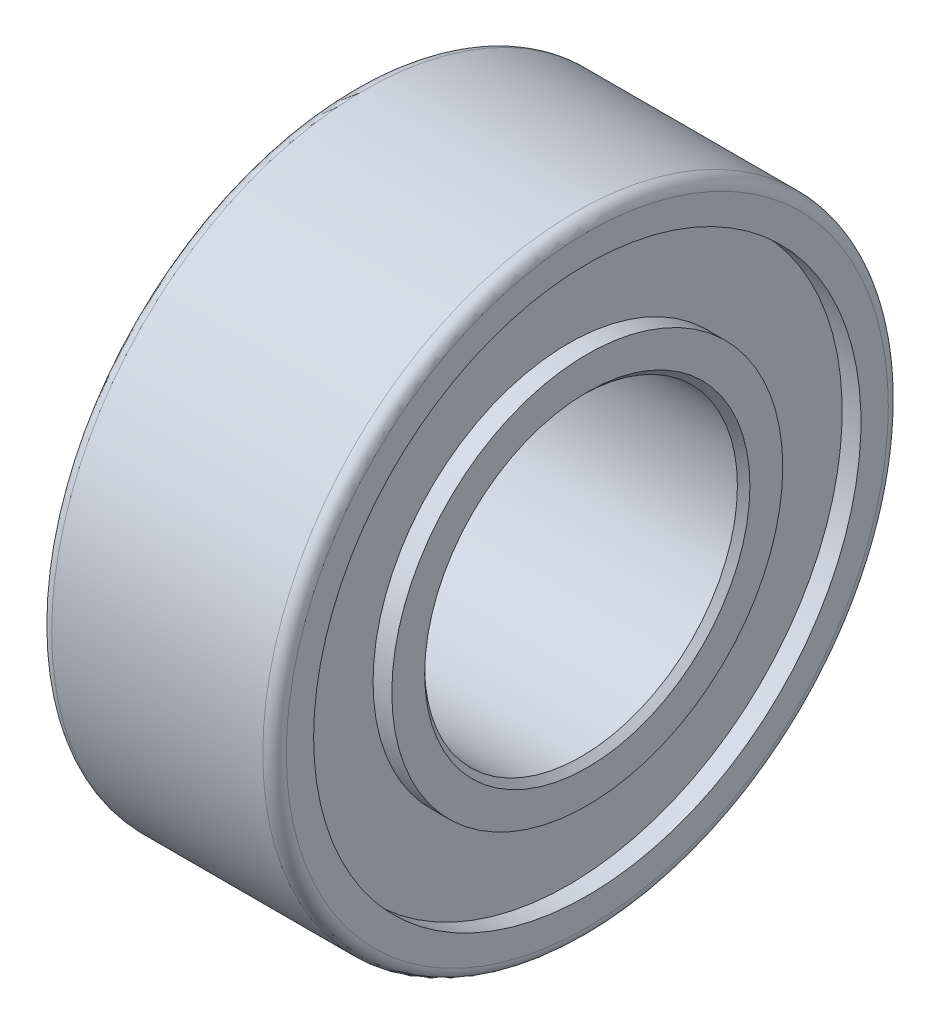
ISO-10303-21;
HEADER;
FILE_DESCRIPTION(('STEP AP214'),'2;1');
FILE_NAME('part.step','',(''),(''),'','','');
FILE_SCHEMA(('AUTOMOTIVE_DESIGN { 1 0 10303 214 1 1 1 1 }'));
ENDSEC;
DATA;
#1=APPLICATION_CONTEXT('core data for automotive mechanical design processes');
#2=APPLICATION_PROTOCOL_DEFINITION('international standard','automotive_design',2000,#1);
#3=PRODUCT_CONTEXT('',#1,'mechanical');
#4=PRODUCT('Part','Part','',(#3));
#5=PRODUCT_RELATED_PRODUCT_CATEGORY('part','',(#4));
#6=PRODUCT_DEFINITION_FORMATION('','',#4);
#7=PRODUCT_DEFINITION_CONTEXT('part definition',#1,'design');
#8=PRODUCT_DEFINITION('design','',#6,#7);
#9=PRODUCT_DEFINITION_SHAPE('','',#8);
#10=(LENGTH_UNIT() NAMED_UNIT(*) SI_UNIT(.MILLI.,.METRE.));
#11=(NAMED_UNIT(*) PLANE_ANGLE_UNIT() SI_UNIT($,.RADIAN.));
#12=(NAMED_UNIT(*) SI_UNIT($,.STERADIAN.) SOLID_ANGLE_UNIT());
#13=UNCERTAINTY_MEASURE_WITH_UNIT(LENGTH_MEASURE(1.E-05),#10,'distance_accuracy_value','');
#14=(GEOMETRIC_REPRESENTATION_CONTEXT(3) GLOBAL_UNCERTAINTY_ASSIGNED_CONTEXT((#13)) GLOBAL_UNIT_ASSIGNED_CONTEXT((#10,
#11,#12)) REPRESENTATION_CONTEXT('',''));
#15=CARTESIAN_POINT('',(0.,0.,0.));
#16=DIRECTION('',(0.,0.,1.));
#17=DIRECTION('',(1.,0.,0.));
#18=AXIS2_PLACEMENT_3D('',#15,#16,#17);
#19=CARTESIAN_POINT('',(0.,0.,0.));
#20=DIRECTION('',(-1.,0.,0.));
#21=DIRECTION('',(0.,0.,1.));
#22=AXIS2_PLACEMENT_3D('',#19,#20,#21);
#23=CYLINDRICAL_SURFACE('',#22,3.175);
#24=CARTESIAN_POINT('',(-2.25424999996449,0.,0.));
#25=DIRECTION('',(-1.,0.,0.));
#26=DIRECTION('',(0.,0.,1.));
#27=AXIS2_PLACEMENT_3D('',#24,#25,#26);
#28=CIRCLE('',#27,3.17499999999882);
#29=CARTESIAN_POINT('',(-2.25424999996449,0.,3.17499999999882));
#30=VERTEX_POINT('',#29);
#31=EDGE_CURVE('E65',#30,#30,#28,.T.);
#32=ORIENTED_EDGE('',*,*,#31,.T.);
#33=EDGE_LOOP('',(#32));
#34=FACE_BOUND('',#33,.T.);
#35=CARTESIAN_POINT('',(2.25425000002133,0.,0.));
#36=DIRECTION('',(1.,0.,0.));
#37=DIRECTION('',(0.,0.,-1.));
#38=AXIS2_PLACEMENT_3D('',#35,#36,#37);
#39=CIRCLE('',#38,3.17500000005566);
#40=CARTESIAN_POINT('',(2.25425000002133,0.,-3.17500000005566));
#41=VERTEX_POINT('',#40);
#42=EDGE_CURVE('E297',#41,#41,#39,.T.);
#43=ORIENTED_EDGE('',*,*,#42,.T.);
#44=EDGE_LOOP('',(#43));
#45=FACE_BOUND('',#44,.T.);
#46=ADVANCED_FACE('F17',(#34,#45),#23,.F.);
#47=CARTESIAN_POINT('',(2.38125000004175,0.,0.));
#48=DIRECTION('',(1.,0.,0.));
#49=DIRECTION('',(0.,0.,-1.));
#50=AXIS2_PLACEMENT_3D('',#47,#48,#49);
#51=CONICAL_SURFACE('',#50,3.30200000001923,0.785398163173655);
#52=CARTESIAN_POINT('',(2.38125000004175,0.,0.));
#53=DIRECTION('',(1.,0.,0.));
#54=DIRECTION('',(0.,0.,-1.));
#55=AXIS2_PLACEMENT_3D('',#52,#53,#54);
#56=CIRCLE('',#55,3.30200000001923);
#57=CARTESIAN_POINT('',(2.38125000004175,0.,-3.30200000001923));
#58=VERTEX_POINT('',#57);
#59=EDGE_CURVE('E319',#58,#58,#56,.T.);
#60=ORIENTED_EDGE('',*,*,#59,.T.);
#61=EDGE_LOOP('',(#60));
#62=FACE_BOUND('',#61,.T.);
#63=ORIENTED_EDGE('',*,*,#42,.F.);
#64=EDGE_LOOP('',(#63));
#65=FACE_BOUND('',#64,.T.);
#66=ADVANCED_FACE('F161',(#62,#65),#51,.F.);
#67=CARTESIAN_POINT('',(-2.38124999992806,0.,0.));
#68=DIRECTION('',(-1.,0.,0.));
#69=DIRECTION('',(0.,0.,1.));
#70=AXIS2_PLACEMENT_3D('',#67,#68,#69);
#71=CONICAL_SURFACE('',#70,3.30199999990555,0.785398163397448);
#72=CARTESIAN_POINT('',(-2.3812499999849,0.,0.));
#73=DIRECTION('',(-1.,0.,0.));
#74=DIRECTION('',(0.,0.,1.));
#75=AXIS2_PLACEMENT_3D('',#72,#73,#74);
#76=CIRCLE('',#75,3.30199999996239);
#77=CARTESIAN_POINT('',(-2.3812499999849,0.,3.30199999996239));
#78=VERTEX_POINT('',#77);
#79=EDGE_CURVE('E316',#78,#78,#76,.T.);
#80=ORIENTED_EDGE('',*,*,#79,.T.);
#81=EDGE_LOOP('',(#80));
#82=FACE_BOUND('',#81,.T.);
#83=ORIENTED_EDGE('',*,*,#31,.F.);
#84=EDGE_LOOP('',(#83));
#85=FACE_BOUND('',#84,.T.);
#86=ADVANCED_FACE('F158',(#82,#85),#71,.F.);
#87=CARTESIAN_POINT('',(2.38125,3.175,0.));
#88=DIRECTION('',(-1.,0.,0.));
#89=DIRECTION('',(0.,0.,1.));
#90=AXIS2_PLACEMENT_3D('',#87,#88,#89);
#91=PLANE('',#90);
#92=CARTESIAN_POINT('',(2.38125,0.,0.));
#93=DIRECTION('',(-1.,0.,0.));
#94=DIRECTION('',(0.,0.,1.));
#95=AXIS2_PLACEMENT_3D('',#92,#93,#94);
#96=CIRCLE('',#95,3.96875);
#97=CARTESIAN_POINT('',(2.38125,0.,3.96875));
#98=VERTEX_POINT('',#97);
#99=EDGE_CURVE('E313',#98,#98,#96,.T.);
#100=ORIENTED_EDGE('',*,*,#99,.F.);
#101=EDGE_LOOP('',(#100));
#102=FACE_BOUND('',#101,.T.);
#103=ORIENTED_EDGE('',*,*,#59,.F.);
#104=EDGE_LOOP('',(#103));
#105=FACE_BOUND('',#104,.T.);
#106=ADVANCED_FACE('F154',(#102,#105),#91,.F.);
#107=CARTESIAN_POINT('',(-2.38125,3.96875,0.));
#108=DIRECTION('',(1.,0.,0.));
#109=DIRECTION('',(0.,0.,-1.));
#110=AXIS2_PLACEMENT_3D('',#107,#108,#109);
#111=PLANE('',#110);
#112=CARTESIAN_POINT('',(-2.38125,0.,0.));
#113=DIRECTION('',(-1.,0.,0.));
#114=DIRECTION('',(0.,0.,1.));
#115=AXIS2_PLACEMENT_3D('',#112,#113,#114);
#116=CIRCLE('',#115,3.96875);
#117=CARTESIAN_POINT('',(-2.38125,0.,3.96875));
#118=VERTEX_POINT('',#117);
#119=EDGE_CURVE('E310',#118,#118,#116,.F.);
#120=ORIENTED_EDGE('',*,*,#119,.F.);
#121=EDGE_LOOP('',(#120));
#122=FACE_BOUND('',#121,.T.);
#123=ORIENTED_EDGE('',*,*,#79,.F.);
#124=EDGE_LOOP('',(#123));
#125=FACE_BOUND('',#124,.T.);
#126=ADVANCED_FACE('F150',(#122,#125),#111,.F.);
#127=CARTESIAN_POINT('',(0.,0.,0.));
#128=DIRECTION('',(-1.,0.,0.));
#129=DIRECTION('',(0.,0.,1.));
#130=AXIS2_PLACEMENT_3D('',#127,#128,#129);
#131=CYLINDRICAL_SURFACE('',#130,3.96875);
#132=CARTESIAN_POINT('',(2.00025,0.,0.));
#133=DIRECTION('',(-1.,0.,0.));
#134=DIRECTION('',(0.,0.,1.));
#135=AXIS2_PLACEMENT_3D('',#132,#133,#134);
#136=CIRCLE('',#135,3.96875);
#137=CARTESIAN_POINT('',(2.00025,0.,3.96875));
#138=VERTEX_POINT('',#137);
#139=EDGE_CURVE('E307',#138,#138,#136,.F.);
#140=ORIENTED_EDGE('',*,*,#139,.T.);
#141=EDGE_LOOP('',(#140));
#142=FACE_BOUND('',#141,.T.);
#143=ORIENTED_EDGE('',*,*,#99,.T.);
#144=EDGE_LOOP('',(#143));
#145=FACE_BOUND('',#144,.T.);
#146=ADVANCED_FACE('F146',(#142,#145),#131,.T.);
#147=CARTESIAN_POINT('',(0.,0.,0.));
#148=DIRECTION('',(-1.,0.,0.));
#149=DIRECTION('',(0.,0.,1.));
#150=AXIS2_PLACEMENT_3D('',#147,#148,#149);
#151=CYLINDRICAL_SURFACE('',#150,3.96875);
#152=ORIENTED_EDGE('',*,*,#119,.T.);
#153=EDGE_LOOP('',(#152));
#154=FACE_BOUND('',#153,.T.);
#155=CARTESIAN_POINT('',(-2.00025,0.,0.));
#156=DIRECTION('',(-1.,0.,0.));
#157=DIRECTION('',(0.,0.,1.));
#158=AXIS2_PLACEMENT_3D('',#155,#156,#157);
#159=CIRCLE('',#158,3.96875);
#160=CARTESIAN_POINT('',(-2.00025,0.,3.96875));
#161=VERTEX_POINT('',#160);
#162=EDGE_CURVE('E304',#161,#161,#159,.T.);
#163=ORIENTED_EDGE('',*,*,#162,.T.);
#164=EDGE_LOOP('',(#163));
#165=FACE_BOUND('',#164,.T.);
#166=ADVANCED_FACE('F142',(#154,#165),#151,.T.);
#167=CARTESIAN_POINT('',(2.00025,3.96875,0.));
#168=DIRECTION('',(-1.,0.,0.));
#169=DIRECTION('',(0.,0.,1.));
#170=AXIS2_PLACEMENT_3D('',#167,#168,#169);
#171=PLANE('',#170);
#172=ORIENTED_EDGE('',*,*,#139,.F.);
#173=EDGE_LOOP('',(#172));
#174=FACE_BOUND('',#173,.T.);
#175=CARTESIAN_POINT('',(2.00025,0.,0.));
#176=DIRECTION('',(-1.,0.,0.));
#177=DIRECTION('',(0.,0.,1.));
#178=AXIS2_PLACEMENT_3D('',#175,#176,#177);
#179=CIRCLE('',#178,5.55625);
#180=CARTESIAN_POINT('',(2.00025,0.,5.55625));
#181=VERTEX_POINT('',#180);
#182=EDGE_CURVE('E301',#181,#181,#179,.F.);
#183=ORIENTED_EDGE('',*,*,#182,.T.);
#184=EDGE_LOOP('',(#183));
#185=FACE_BOUND('',#184,.T.);
#186=ADVANCED_FACE('F138',(#174,#185),#171,.F.);
#187=CARTESIAN_POINT('',(-2.00025,5.55625,0.));
#188=DIRECTION('',(1.,0.,0.));
#189=DIRECTION('',(0.,0.,-1.));
#190=AXIS2_PLACEMENT_3D('',#187,#188,#189);
#191=PLANE('',#190);
#192=CARTESIAN_POINT('',(-2.00025,0.,0.));
#193=DIRECTION('',(-1.,0.,0.));
#194=DIRECTION('',(0.,0.,1.));
#195=AXIS2_PLACEMENT_3D('',#192,#193,#194);
#196=CIRCLE('',#195,5.55625);
#197=CARTESIAN_POINT('',(-2.00025,0.,5.55625));
#198=VERTEX_POINT('',#197);
#199=EDGE_CURVE('E295',#198,#198,#196,.T.);
#200=ORIENTED_EDGE('',*,*,#199,.T.);
#201=EDGE_LOOP('',(#200));
#202=FACE_BOUND('',#201,.T.);
#203=ORIENTED_EDGE('',*,*,#162,.F.);
#204=EDGE_LOOP('',(#203));
#205=FACE_BOUND('',#204,.T.);
#206=ADVANCED_FACE('F134',(#202,#205),#191,.F.);
#207=CARTESIAN_POINT('',(0.,0.,0.));
#208=DIRECTION('',(-1.,0.,0.));
#209=DIRECTION('',(0.,0.,1.));
#210=AXIS2_PLACEMENT_3D('',#207,#208,#209);
#211=CYLINDRICAL_SURFACE('',#210,5.55625);
#212=CARTESIAN_POINT('',(2.38125,0.,0.));
#213=DIRECTION('',(-1.,0.,0.));
#214=DIRECTION('',(0.,0.,1.));
#215=AXIS2_PLACEMENT_3D('',#212,#213,#214);
#216=CIRCLE('',#215,5.55625);
#217=CARTESIAN_POINT('',(2.38125,0.,5.55625));
#218=VERTEX_POINT('',#217);
#219=EDGE_CURVE('E292',#218,#218,#216,.F.);
#220=ORIENTED_EDGE('',*,*,#219,.T.);
#221=EDGE_LOOP('',(#220));
#222=FACE_BOUND('',#221,.T.);
#223=ORIENTED_EDGE('',*,*,#182,.F.);
#224=EDGE_LOOP('',(#223));
#225=FACE_BOUND('',#224,.T.);
#226=ADVANCED_FACE('F130',(#222,#225),#211,.F.);
#227=CARTESIAN_POINT('',(0.,0.,0.));
#228=DIRECTION('',(-1.,0.,0.));
#229=DIRECTION('',(0.,0.,1.));
#230=AXIS2_PLACEMENT_3D('',#227,#228,#229);
#231=CYLINDRICAL_SURFACE('',#230,5.55625);
#232=ORIENTED_EDGE('',*,*,#199,.F.);
#233=EDGE_LOOP('',(#232));
#234=FACE_BOUND('',#233,.T.);
#235=CARTESIAN_POINT('',(-2.38125,0.,0.));
#236=DIRECTION('',(-1.,0.,0.));
#237=DIRECTION('',(0.,0.,1.));
#238=AXIS2_PLACEMENT_3D('',#235,#236,#237);
#239=CIRCLE('',#238,5.55625);
#240=CARTESIAN_POINT('',(-2.38125,0.,5.55625));
#241=VERTEX_POINT('',#240);
#242=EDGE_CURVE('E52',#241,#241,#239,.T.);
#243=ORIENTED_EDGE('',*,*,#242,.T.);
#244=EDGE_LOOP('',(#243));
#245=FACE_BOUND('',#244,.T.);
#246=ADVANCED_FACE('F125',(#234,#245),#231,.F.);
#247=CARTESIAN_POINT('',(2.38125,5.55625,0.));
#248=DIRECTION('',(-1.,0.,0.));
#249=DIRECTION('',(0.,0.,1.));
#250=AXIS2_PLACEMENT_3D('',#247,#248,#249);
#251=PLANE('',#250);
#252=ORIENTED_EDGE('',*,*,#219,.F.);
#253=EDGE_LOOP('',(#252));
#254=FACE_BOUND('',#253,.T.);
#255=CARTESIAN_POINT('',(2.38125,0.,0.));
#256=DIRECTION('',(-1.,0.,0.));
#257=DIRECTION('',(0.,0.,1.));
#258=AXIS2_PLACEMENT_3D('',#255,#256,#257);
#259=CIRCLE('',#258,6.111875);
#260=CARTESIAN_POINT('',(2.38125,0.,6.111875));
#261=VERTEX_POINT('',#260);
#262=CARTESIAN_POINT('',(2.38125,0.,-6.111875));
#263=VERTEX_POINT('',#262);
#264=EDGE_CURVE('E45',#261,#263,#259,.T.);
#265=ORIENTED_EDGE('',*,*,#264,.F.);
#266=CARTESIAN_POINT('',(2.38125,0.,0.));
#267=DIRECTION('',(-1.,0.,0.));
#268=DIRECTION('',(0.,0.,-1.));
#269=AXIS2_PLACEMENT_3D('',#266,#267,#268);
#270=CIRCLE('',#269,6.111875);
#271=EDGE_CURVE('E48',#263,#261,#270,.T.);
#272=ORIENTED_EDGE('',*,*,#271,.F.);
#273=EDGE_LOOP('',(#265,#272));
#274=FACE_BOUND('',#273,.T.);
#275=ADVANCED_FACE('F50',(#254,#274),#251,.F.);
#276=CARTESIAN_POINT('',(-2.38125,6.35,0.));
#277=DIRECTION('',(1.,0.,0.));
#278=DIRECTION('',(0.,0.,-1.));
#279=AXIS2_PLACEMENT_3D('',#276,#277,#278);
#280=PLANE('',#279);
#281=ORIENTED_EDGE('',*,*,#242,.F.);
#282=EDGE_LOOP('',(#281));
#283=FACE_BOUND('',#282,.T.);
#284=CARTESIAN_POINT('',(-2.38125,0.,0.));
#285=DIRECTION('',(1.,0.,0.));
#286=DIRECTION('',(0.,0.,-1.));
#287=AXIS2_PLACEMENT_3D('',#284,#285,#286);
#288=CIRCLE('',#287,6.111875);
#289=CARTESIAN_POINT('',(-2.38125,0.,-6.111875));
#290=VERTEX_POINT('',#289);
#291=CARTESIAN_POINT('',(-2.38125,0.,6.111875));
#292=VERTEX_POINT('',#291);
#293=EDGE_CURVE('E57',#290,#292,#288,.T.);
#294=ORIENTED_EDGE('',*,*,#293,.F.);
#295=CARTESIAN_POINT('',(-2.38125,0.,0.));
#296=DIRECTION('',(1.,0.,0.));
#297=DIRECTION('',(0.,0.,1.));
#298=AXIS2_PLACEMENT_3D('',#295,#296,#297);
#299=CIRCLE('',#298,6.111875);
#300=EDGE_CURVE('E36',#292,#290,#299,.T.);
#301=ORIENTED_EDGE('',*,*,#300,.F.);
#302=EDGE_LOOP('',(#294,#301));
#303=FACE_BOUND('',#302,.T.);
#304=ADVANCED_FACE('F78',(#283,#303),#280,.F.);
#305=CARTESIAN_POINT('',(2.143125,0.,0.));
#306=DIRECTION('',(-1.,0.,0.));
#307=DIRECTION('',(0.,0.,1.));
#308=AXIS2_PLACEMENT_3D('',#305,#306,#307);
#309=TOROIDAL_SURFACE('',#308,6.111875,0.238125);
#310=CARTESIAN_POINT('',(2.143125,0.,0.));
#311=DIRECTION('',(-1.,0.,0.));
#312=DIRECTION('',(0.,0.,1.));
#313=AXIS2_PLACEMENT_3D('',#310,#311,#312);
#314=CIRCLE('',#313,6.35);
#315=CARTESIAN_POINT('',(2.143125,0.,6.35));
#316=VERTEX_POINT('',#315);
#317=EDGE_CURVE('E28',#316,#316,#314,.T.);
#318=ORIENTED_EDGE('',*,*,#317,.F.);
#319=EDGE_LOOP('',(#318));
#320=FACE_BOUND('',#319,.T.);
#321=ORIENTED_EDGE('',*,*,#264,.T.);
#322=ORIENTED_EDGE('',*,*,#271,.T.);
#323=EDGE_LOOP('',(#321,#322));
#324=FACE_BOUND('',#323,.T.);
#325=ADVANCED_FACE('F56',(#320,#324),#309,.T.);
#326=CARTESIAN_POINT('',(-2.143125,0.,0.));
#327=DIRECTION('',(1.,0.,0.));
#328=DIRECTION('',(0.,0.,-1.));
#329=AXIS2_PLACEMENT_3D('',#326,#327,#328);
#330=TOROIDAL_SURFACE('',#329,6.111875,0.238125);
#331=CARTESIAN_POINT('',(-2.143125,0.,0.));
#332=DIRECTION('',(-1.,0.,0.));
#333=DIRECTION('',(0.,0.,1.));
#334=AXIS2_PLACEMENT_3D('',#331,#332,#333);
#335=CIRCLE('',#334,6.35);
#336=CARTESIAN_POINT('',(-2.143125,0.,6.35));
#337=VERTEX_POINT('',#336);
#338=EDGE_CURVE('E11',#337,#337,#335,.F.);
#339=ORIENTED_EDGE('',*,*,#338,.F.);
#340=EDGE_LOOP('',(#339));
#341=FACE_BOUND('',#340,.T.);
#342=ORIENTED_EDGE('',*,*,#293,.T.);
#343=ORIENTED_EDGE('',*,*,#300,.T.);
#344=EDGE_LOOP('',(#342,#343));
#345=FACE_BOUND('',#344,.T.);
#346=ADVANCED_FACE('F77',(#341,#345),#330,.T.);
#347=CARTESIAN_POINT('',(0.,0.,0.));
#348=DIRECTION('',(-1.,0.,0.));
#349=DIRECTION('',(0.,0.,1.));
#350=AXIS2_PLACEMENT_3D('',#347,#348,#349);
#351=CYLINDRICAL_SURFACE('',#350,6.35);
#352=ORIENTED_EDGE('',*,*,#338,.T.);
#353=EDGE_LOOP('',(#352));
#354=FACE_BOUND('',#353,.T.);
#355=ORIENTED_EDGE('',*,*,#317,.T.);
#356=EDGE_LOOP('',(#355));
#357=FACE_BOUND('',#356,.T.);
#358=ADVANCED_FACE('F173',(#354,#357),#351,.T.);
#359=CLOSED_SHELL('',(#46,#66,#86,#106,#126,#146,#166,#186,#206,#226,#246,#275,#304,#325,#346,#358));
#360=MANIFOLD_SOLID_BREP('B1',#359);
#361=ADVANCED_BREP_SHAPE_REPRESENTATION('',(#18,#360),#14);
#362=SHAPE_DEFINITION_REPRESENTATION(#9,#361);
ENDSEC;
END-ISO-10303-21;
